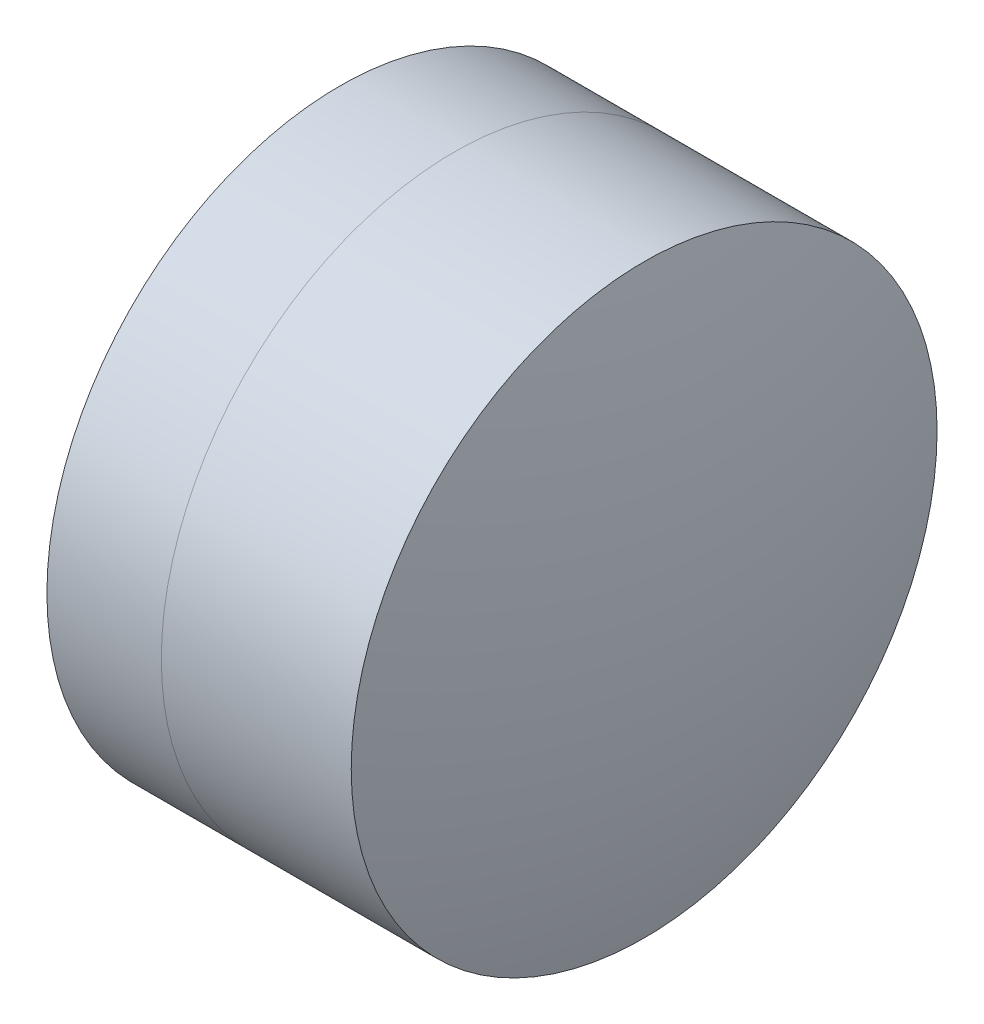
ISO-10303-21;
HEADER;
FILE_DESCRIPTION(('STEP AP214'),'2;1');
FILE_NAME('part.step','',(''),(''),'','','');
FILE_SCHEMA(('AUTOMOTIVE_DESIGN { 1 0 10303 214 1 1 1 1 }'));
ENDSEC;
DATA;
#1=APPLICATION_CONTEXT('core data for automotive mechanical design processes');
#2=APPLICATION_PROTOCOL_DEFINITION('international standard','automotive_design',2000,#1);
#3=PRODUCT_CONTEXT('',#1,'mechanical');
#4=PRODUCT('Part','Part','',(#3));
#5=PRODUCT_RELATED_PRODUCT_CATEGORY('part','',(#4));
#6=PRODUCT_DEFINITION_FORMATION('','',#4);
#7=PRODUCT_DEFINITION_CONTEXT('part definition',#1,'design');
#8=PRODUCT_DEFINITION('design','',#6,#7);
#9=PRODUCT_DEFINITION_SHAPE('','',#8);
#10=(LENGTH_UNIT() NAMED_UNIT(*) SI_UNIT(.MILLI.,.METRE.));
#11=(NAMED_UNIT(*) PLANE_ANGLE_UNIT() SI_UNIT($,.RADIAN.));
#12=(NAMED_UNIT(*) SI_UNIT($,.STERADIAN.) SOLID_ANGLE_UNIT());
#13=UNCERTAINTY_MEASURE_WITH_UNIT(LENGTH_MEASURE(1.E-05),#10,'distance_accuracy_value','');
#14=(GEOMETRIC_REPRESENTATION_CONTEXT(3) GLOBAL_UNCERTAINTY_ASSIGNED_CONTEXT((#13)) GLOBAL_UNIT_ASSIGNED_CONTEXT((#10,
#11,#12)) REPRESENTATION_CONTEXT('',''));
#15=CARTESIAN_POINT('',(0.,0.,0.));
#16=DIRECTION('',(0.,0.,1.));
#17=DIRECTION('',(1.,0.,0.));
#18=AXIS2_PLACEMENT_3D('',#15,#16,#17);
#19=CARTESIAN_POINT('',(-1.34204051591689,0.,0.));
#20=DIRECTION('',(-1.,0.,0.));
#21=DIRECTION('',(0.,0.,-1.));
#22=AXIS2_PLACEMENT_3D('',#19,#20,#21);
#23=SPHERICAL_SURFACE('',#22,4.89);
#24=CARTESIAN_POINT('',(2.3770285880391,0.,0.));
#25=DIRECTION('',(-1.,0.,0.));
#26=DIRECTION('',(0.,0.,1.));
#27=AXIS2_PLACEMENT_3D('',#24,#25,#26);
#28=CIRCLE('',#27,3.175);
#29=CARTESIAN_POINT('',(2.3770285880391,0.,3.175));
#30=VERTEX_POINT('',#29);
#31=EDGE_CURVE('E51',#30,#30,#28,.T.);
#32=ORIENTED_EDGE('',*,*,#31,.T.);
#33=EDGE_LOOP('',(#32));
#34=FACE_BOUND('',#33,.T.);
#35=ADVANCED_FACE('F45',(#34),#23,.F.);
#36=CARTESIAN_POINT('',(-7.57204051591689,0.,0.));
#37=DIRECTION('',(-1.,0.,0.));
#38=DIRECTION('',(0.,0.,-1.));
#39=AXIS2_PLACEMENT_3D('',#36,#37,#38);
#40=SPHERICAL_SURFACE('',#39,12.42);
#41=CARTESIAN_POINT('',(4.43528120876426,0.,0.));
#42=DIRECTION('',(-1.,0.,0.));
#43=DIRECTION('',(0.,0.,1.));
#44=AXIS2_PLACEMENT_3D('',#41,#42,#43);
#45=CIRCLE('',#44,3.175);
#46=CARTESIAN_POINT('',(4.43528120876426,0.,3.175));
#47=VERTEX_POINT('',#46);
#48=EDGE_CURVE('E11',#47,#47,#45,.T.);
#49=ORIENTED_EDGE('',*,*,#48,.F.);
#50=EDGE_LOOP('',(#49));
#51=FACE_BOUND('',#50,.T.);
#52=ADVANCED_FACE('F60',(#51),#40,.T.);
#53=CARTESIAN_POINT('',(-0.551919992657797,0.,0.));
#54=DIRECTION('',(-1.,0.,0.));
#55=DIRECTION('',(0.,0.,1.));
#56=AXIS2_PLACEMENT_3D('',#53,#54,#55);
#57=CYLINDRICAL_SURFACE('',#56,3.175);
#58=ORIENTED_EDGE('',*,*,#48,.T.);
#59=EDGE_LOOP('',(#58));
#60=FACE_BOUND('',#59,.T.);
#61=ORIENTED_EDGE('',*,*,#31,.F.);
#62=EDGE_LOOP('',(#61));
#63=FACE_BOUND('',#62,.T.);
#64=ADVANCED_FACE('F58',(#60,#63),#57,.T.);
#65=CLOSED_SHELL('',(#35,#52,#64));
#66=MANIFOLD_SOLID_BREP('B2',#65);
#67=CARTESIAN_POINT('',(13.8979594840831,0.,0.));
#68=DIRECTION('',(-1.,0.,0.));
#69=DIRECTION('',(0.,0.,1.));
#70=AXIS2_PLACEMENT_3D('',#67,#68,#69);
#71=SPHERICAL_SURFACE('',#70,13.15);
#72=CARTESIAN_POINT('',(1.13700830480184,0.,0.));
#73=DIRECTION('',(-1.,0.,0.));
#74=DIRECTION('',(0.,0.,1.));
#75=AXIS2_PLACEMENT_3D('',#72,#73,#74);
#76=CIRCLE('',#75,3.175);
#77=CARTESIAN_POINT('',(1.13700830480184,0.,3.175));
#78=VERTEX_POINT('',#77);
#79=EDGE_CURVE('E44',#78,#78,#76,.T.);
#80=ORIENTED_EDGE('',*,*,#79,.T.);
#81=EDGE_LOOP('',(#80));
#82=FACE_BOUND('',#81,.T.);
#83=ADVANCED_FACE('F86',(#82),#71,.T.);
#84=CARTESIAN_POINT('',(-0.816062176165804,0.,0.));
#85=DIRECTION('',(-1.,0.,0.));
#86=DIRECTION('',(0.,0.,1.));
#87=AXIS2_PLACEMENT_3D('',#84,#85,#86);
#88=CYLINDRICAL_SURFACE('',#87,3.175);
#89=CARTESIAN_POINT('',(2.3770285880391,0.,0.));
#90=DIRECTION('',(-1.,0.,0.));
#91=DIRECTION('',(0.,0.,1.));
#92=AXIS2_PLACEMENT_3D('',#89,#90,#91);
#93=CIRCLE('',#92,3.175);
#94=CARTESIAN_POINT('',(2.3770285880391,0.,3.175));
#95=VERTEX_POINT('',#94);
#96=EDGE_CURVE('E92',#95,#95,#93,.T.);
#97=ORIENTED_EDGE('',*,*,#96,.T.);
#98=EDGE_LOOP('',(#97));
#99=FACE_BOUND('',#98,.T.);
#100=ORIENTED_EDGE('',*,*,#79,.F.);
#101=EDGE_LOOP('',(#100));
#102=FACE_BOUND('',#101,.T.);
#103=ADVANCED_FACE('F98',(#99,#102),#88,.T.);
#104=CARTESIAN_POINT('',(-1.34204051591689,0.,0.));
#105=DIRECTION('',(-1.,0.,0.));
#106=DIRECTION('',(0.,0.,1.));
#107=AXIS2_PLACEMENT_3D('',#104,#105,#106);
#108=SPHERICAL_SURFACE('',#107,4.89);
#109=ORIENTED_EDGE('',*,*,#96,.F.);
#110=EDGE_LOOP('',(#109));
#111=FACE_BOUND('',#110,.T.);
#112=ADVANCED_FACE('F101',(#111),#108,.T.);
#113=CLOSED_SHELL('',(#83,#103,#112));
#114=MANIFOLD_SOLID_BREP('B6',#113);
#115=ADVANCED_BREP_SHAPE_REPRESENTATION('',(#18,#66,#114),#14);
#116=SHAPE_DEFINITION_REPRESENTATION(#9,#115);
ENDSEC;
END-ISO-10303-21;
